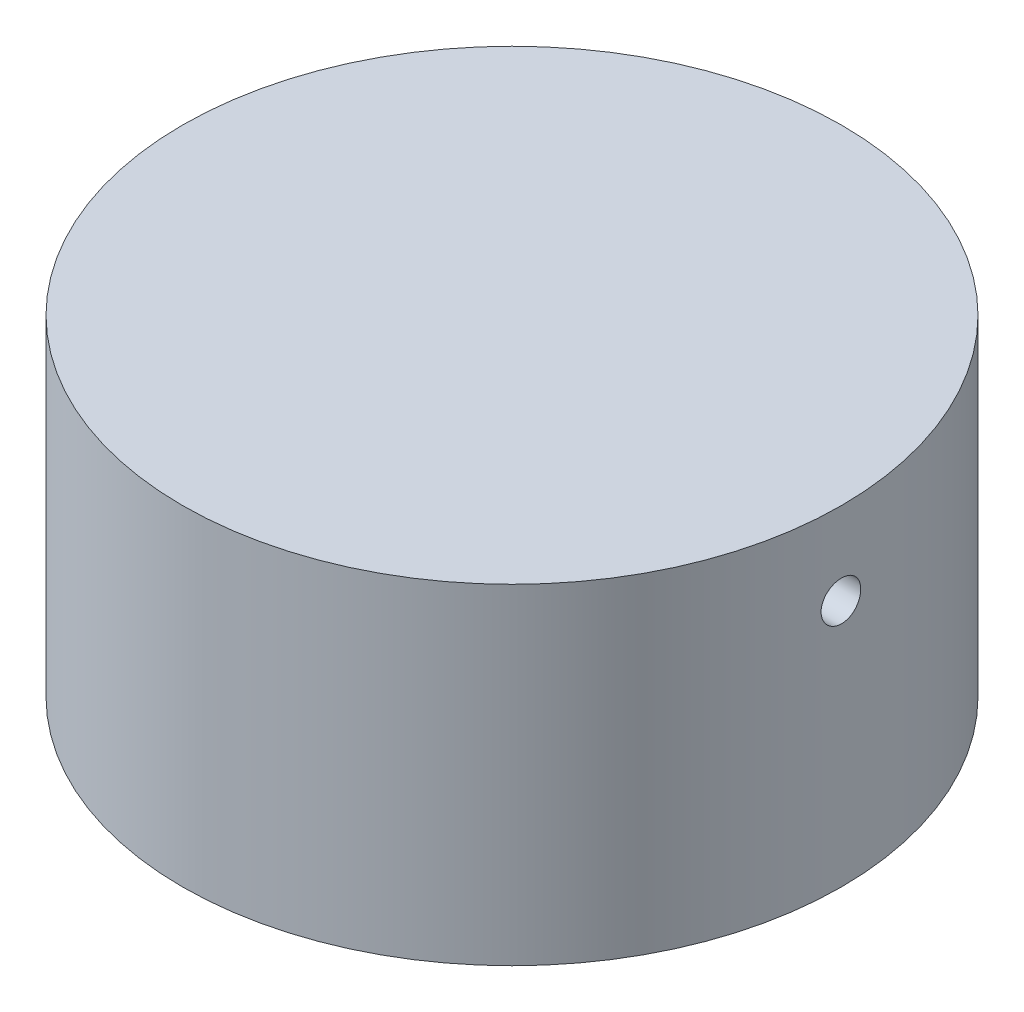
ISO-10303-21;
HEADER;
FILE_DESCRIPTION(('STEP AP214'),'2;1');
FILE_NAME('part.step','',(''),(''),'','','');
FILE_SCHEMA(('AUTOMOTIVE_DESIGN { 1 0 10303 214 1 1 1 1 }'));
ENDSEC;
DATA;
#1=APPLICATION_CONTEXT('core data for automotive mechanical design processes');
#2=APPLICATION_PROTOCOL_DEFINITION('international standard','automotive_design',2000,#1);
#3=PRODUCT_CONTEXT('',#1,'mechanical');
#4=PRODUCT('Part','Part','',(#3));
#5=PRODUCT_RELATED_PRODUCT_CATEGORY('part','',(#4));
#6=PRODUCT_DEFINITION_FORMATION('','',#4);
#7=PRODUCT_DEFINITION_CONTEXT('part definition',#1,'design');
#8=PRODUCT_DEFINITION('design','',#6,#7);
#9=PRODUCT_DEFINITION_SHAPE('','',#8);
#10=(LENGTH_UNIT() NAMED_UNIT(*) SI_UNIT(.MILLI.,.METRE.));
#11=(NAMED_UNIT(*) PLANE_ANGLE_UNIT() SI_UNIT($,.RADIAN.));
#12=(NAMED_UNIT(*) SI_UNIT($,.STERADIAN.) SOLID_ANGLE_UNIT());
#13=UNCERTAINTY_MEASURE_WITH_UNIT(LENGTH_MEASURE(1.E-05),#10,'distance_accuracy_value','');
#14=(GEOMETRIC_REPRESENTATION_CONTEXT(3) GLOBAL_UNCERTAINTY_ASSIGNED_CONTEXT((#13)) GLOBAL_UNIT_ASSIGNED_CONTEXT((#10,
#11,#12)) REPRESENTATION_CONTEXT('',''));
#15=CARTESIAN_POINT('',(0.,0.,0.));
#16=DIRECTION('',(0.,0.,1.));
#17=DIRECTION('',(1.,0.,0.));
#18=AXIS2_PLACEMENT_3D('',#15,#16,#17);
#19=CARTESIAN_POINT('',(0.,20.,0.));
#20=DIRECTION('',(0.,-1.,0.));
#21=DIRECTION('',(0.,0.,-1.));
#22=AXIS2_PLACEMENT_3D('',#19,#20,#21);
#23=CYLINDRICAL_SURFACE('',#22,19.95);
#24=CARTESIAN_POINT('',(0.,20.,0.));
#25=DIRECTION('',(0.,1.,0.));
#26=DIRECTION('',(0.,0.,1.));
#27=AXIS2_PLACEMENT_3D('',#24,#25,#26);
#28=CIRCLE('',#27,19.95);
#29=CARTESIAN_POINT('',(0.,20.,19.95));
#30=VERTEX_POINT('',#29);
#31=EDGE_CURVE('E41',#30,#30,#28,.T.);
#32=ORIENTED_EDGE('',*,*,#31,.F.);
#33=EDGE_LOOP('',(#32));
#34=FACE_BOUND('',#33,.T.);
#35=CARTESIAN_POINT('',(0.,0.,0.));
#36=DIRECTION('',(0.,1.,0.));
#37=DIRECTION('',(0.,0.,1.));
#38=AXIS2_PLACEMENT_3D('',#35,#36,#37);
#39=CIRCLE('',#38,19.95);
#40=CARTESIAN_POINT('',(0.,0.,19.95));
#41=VERTEX_POINT('',#40);
#42=EDGE_CURVE('E45',#41,#41,#39,.T.);
#43=ORIENTED_EDGE('',*,*,#42,.T.);
#44=EDGE_LOOP('',(#43));
#45=FACE_BOUND('',#44,.T.);
#46=CARTESIAN_POINT('',(19.95,16.2,0.));
#47=CARTESIAN_POINT('',(19.9499995195904,16.1999970351863,-0.0673392032796888));
#48=CARTESIAN_POINT('',(19.9496554077135,16.1943127447382,-0.134725680956868));
#49=CARTESIAN_POINT('',(19.9483157594732,16.1717183718967,-0.267638299253196));
#50=CARTESIAN_POINT('',(19.9473194630176,16.1547951907403,-0.333162176005475));
#51=CARTESIAN_POINT('',(19.9447881649979,16.1102105505326,-0.460405083456329));
#52=CARTESIAN_POINT('',(19.943253445673,16.0825547166897,-0.522126087716028));
#53=CARTESIAN_POINT('',(19.9398179626935,16.0172988417651,-0.640033554035088));
#54=CARTESIAN_POINT('',(19.9379172834248,15.9797010924182,-0.696221287490771));
#55=CARTESIAN_POINT('',(19.9339605892219,15.8955709094578,-0.801562049717841));
#56=CARTESIAN_POINT('',(19.9319043859548,15.8490275345117,-0.850706333858018));
#57=CARTESIAN_POINT('',(19.9278700006221,15.7483497355697,-0.940490432843658));
#58=CARTESIAN_POINT('',(19.9258918218043,15.6942149960046,-0.981129893972719));
#59=CARTESIAN_POINT('',(19.9222351322824,15.5798422018062,-1.0527772472416));
#60=CARTESIAN_POINT('',(19.9205568458935,15.519599630955,-1.08377794244232));
#61=CARTESIAN_POINT('',(19.9176916170996,15.3947529235156,-1.13522169841728));
#62=CARTESIAN_POINT('',(19.91650466973,15.3301488310042,-1.15566486586629));
#63=CARTESIAN_POINT('',(19.914757750636,15.1984966195089,-1.18538916906495));
#64=CARTESIAN_POINT('',(19.9141970147641,15.1314515825788,-1.19468390993904));
#65=CARTESIAN_POINT('',(19.9137634633373,14.9967507476594,-1.20188951111929));
#66=CARTESIAN_POINT('',(19.9138906404758,14.9290949561648,-1.19980049233756));
#67=CARTESIAN_POINT('',(19.9148178637493,14.7951857693218,-1.18430917148815));
#68=CARTESIAN_POINT('',(19.9156170345251,14.7289306644413,-1.17092158719099));
#69=CARTESIAN_POINT('',(19.9177968022749,14.5996098153393,-1.13323598396327));
#70=CARTESIAN_POINT('',(19.9191774025227,14.5365440890785,-1.10893790359828));
#71=CARTESIAN_POINT('',(19.9223654479041,14.4153448911841,-1.05010431282407));
#72=CARTESIAN_POINT('',(19.9241731715369,14.3572146714323,-1.01556211912966));
#73=CARTESIAN_POINT('',(19.9280114590695,14.2475721449587,-0.937225675866416));
#74=CARTESIAN_POINT('',(19.9300420252834,14.1960599069753,-0.893431330211505));
#75=CARTESIAN_POINT('',(19.9341010475429,14.1010299504446,-0.797750817738639));
#76=CARTESIAN_POINT('',(19.9361294951175,14.0575250566162,-0.745851912013491));
#77=CARTESIAN_POINT('',(19.9399525798967,13.9798436353991,-0.635480180178088));
#78=CARTESIAN_POINT('',(19.9417472170252,13.9456671110508,-0.57700735192529));
#79=CARTESIAN_POINT('',(19.9449005750174,13.8876136900558,-0.455139882315349));
#80=CARTESIAN_POINT('',(19.9462592756537,13.8637372713172,-0.391745012744579));
#81=CARTESIAN_POINT('',(19.9483873735973,13.826970354815,-0.261836452719707));
#82=CARTESIAN_POINT('',(19.9491567772803,13.8140797381936,-0.195322796016677));
#83=CARTESIAN_POINT('',(19.950018757673,13.79966621713,-0.0611760252065578));
#84=CARTESIAN_POINT('',(19.9501123901849,13.7981255797821,0.00645517708886048));
#85=CARTESIAN_POINT('',(19.9496150841528,13.8064094285311,0.141015069411963));
#86=CARTESIAN_POINT('',(19.9490241489047,13.816233859909,0.207943762820426));
#87=CARTESIAN_POINT('',(19.9472249184295,13.8469542849077,0.33914887631927));
#88=CARTESIAN_POINT('',(19.9460170764425,13.867842150663,0.403427206209046));
#89=CARTESIAN_POINT('',(19.9431199392638,13.9200882625678,0.527565888981595));
#90=CARTESIAN_POINT('',(19.9414306400592,13.9514465959875,0.587426205035611));
#91=CARTESIAN_POINT('',(19.9377578190668,14.0237886896944,0.701110895163078));
#92=CARTESIAN_POINT('',(19.9357739361035,14.0647843022994,0.754927715293815));
#93=CARTESIAN_POINT('',(19.9317364549201,14.1552199742877,0.854921726310395));
#94=CARTESIAN_POINT('',(19.9296828560629,14.2046601108538,0.901098847361945));
#95=CARTESIAN_POINT('',(19.9257343505628,14.3106578676631,0.984562655236377));
#96=CARTESIAN_POINT('',(19.923839651185,14.3672245502967,1.02183784410185));
#97=CARTESIAN_POINT('',(19.9204259016608,14.4858240817493,1.08636104583933));
#98=CARTESIAN_POINT('',(19.9189068493368,14.5478568988777,1.11360911684032));
#99=CARTESIAN_POINT('',(19.9164171909963,14.6755856951122,1.15728467135809));
#100=CARTESIAN_POINT('',(19.9154462172756,14.7412791856964,1.17371941073558));
#101=CARTESIAN_POINT('',(19.9141611909468,14.8744991521949,1.19532548423121));
#102=CARTESIAN_POINT('',(19.9138471323921,14.9420256115113,1.20049692030685));
#103=CARTESIAN_POINT('',(19.9139114967882,15.0768803374791,1.19942861527321));
#104=CARTESIAN_POINT('',(19.9142888226519,15.1442087486174,1.1932069527117));
#105=CARTESIAN_POINT('',(19.915691111094,15.2768631173949,1.1695665200641));
#106=CARTESIAN_POINT('',(19.9167160748594,15.3421890713631,1.15214772945225));
#107=CARTESIAN_POINT('',(19.9192978667085,15.4689870826039,1.10661149791898));
#108=CARTESIAN_POINT('',(19.9208546928107,15.5304591542335,1.07849409685613));
#109=CARTESIAN_POINT('',(19.924324731862,15.6478121967807,1.01236137958934));
#110=CARTESIAN_POINT('',(19.9262379352313,15.7036933179271,0.974346329434146));
#111=CARTESIAN_POINT('',(19.9302086507683,15.8083696715435,0.889430890706554));
#112=CARTESIAN_POINT('',(19.9322663712657,15.8571543497542,0.842517501960036));
#113=CARTESIAN_POINT('',(19.9362925064283,15.946172294726,0.741153238198399));
#114=CARTESIAN_POINT('',(19.9382608990957,15.9864034639958,0.686700519782012));
#115=CARTESIAN_POINT('',(19.9418884756427,16.0571997663253,0.571745286728831));
#116=CARTESIAN_POINT('',(19.9435472920627,16.0877534420354,0.511235711937476));
#117=CARTESIAN_POINT('',(19.9463637675672,16.1382304581597,0.385979810615524));
#118=CARTESIAN_POINT('',(19.9475220143162,16.1581662702803,0.321238555450199));
#119=CARTESIAN_POINT('',(19.9489027390691,16.1816503999745,0.213416622691533));
#120=CARTESIAN_POINT('',(19.9493123874184,16.1885226253078,0.171033198221018));
#121=CARTESIAN_POINT('',(19.9498611707259,16.1976983667314,0.0857729098675622));
#122=CARTESIAN_POINT('',(19.9500003060279,16.2000018886292,0.0428960466119071));
#123=CARTESIAN_POINT('',(19.95,16.2,0.));
#124=B_SPLINE_CURVE_WITH_KNOTS('',3,(#46,#47,#48,#49,#50,#51,#52,#53,#54,#55,#56,#57,#58,#59,
#60,#61,#62,#63,#64,#65,#66,#67,#68,#69,#70,#71,#72,#73,#74,#75,#76,#77,#78,#79,#80,#81,#82,#83,
#84,#85,#86,#87,#88,#89,#90,#91,#92,#93,#94,#95,#96,#97,#98,#99,#100,#101,#102,#103,#104,#105,
#106,#107,#108,#109,#110,#111,#112,#113,#114,#115,#116,#117,#118,#119,#120,#121,#122,#123),
.UNSPECIFIED.,.T.,.F.,(4,2,2,2,2,2,2,2,2,2,2,2,2,2,2,2,2,2,2,2,2,2,2,2,2,2,2,2,2,2,2,2,2,2,2,2,
2,2,4),(0.,0.201861015751006,0.403957711420681,0.605948626715365,0.807893021124415,
1.01008600246821,1.21228739136694,1.4146393966068,1.61698935721326,1.81909212539658,
2.02119274695837,2.22303051322735,2.42486941601134,2.62684028976704,2.82881326114743,
3.03110695375412,3.23340071229165,3.43570385591777,3.6380048107531,3.83998962879593,
4.04197347435382,4.24380913581333,4.44564647959373,4.64773336189573,4.84982209136671,
5.05217044878969,5.25451763314484,5.45672890153618,5.65893833946631,5.86082718983648,
6.0627164102957,6.26460487860676,6.46648792071711,6.66866821120788,6.87089802330792,
7.07336637147005,7.27559637357068,7.40418492415781,7.53277331129416),.UNSPECIFIED.);
#125=CARTESIAN_POINT('',(19.95,16.2,0.));
#126=VERTEX_POINT('',#125);
#127=EDGE_CURVE('E50',#126,#126,#124,.T.);
#128=ORIENTED_EDGE('',*,*,#127,.T.);
#129=EDGE_LOOP('',(#128));
#130=FACE_BOUND('',#129,.T.);
#131=ADVANCED_FACE('F35',(#34,#45,#130),#23,.T.);
#132=CARTESIAN_POINT('',(0.,20.,0.));
#133=DIRECTION('',(0.,1.,0.));
#134=DIRECTION('',(0.,0.,1.));
#135=AXIS2_PLACEMENT_3D('',#132,#133,#134);
#136=PLANE('',#135);
#137=ORIENTED_EDGE('',*,*,#31,.T.);
#138=EDGE_LOOP('',(#137));
#139=FACE_BOUND('',#138,.T.);
#140=ADVANCED_FACE('F67',(#139),#136,.T.);
#141=CARTESIAN_POINT('',(0.,0.,0.));
#142=DIRECTION('',(0.,1.,0.));
#143=DIRECTION('',(0.,0.,1.));
#144=AXIS2_PLACEMENT_3D('',#141,#142,#143);
#145=PLANE('',#144);
#146=CARTESIAN_POINT('',(15.,0.,0.));
#147=DIRECTION('',(0.,-1.,0.));
#148=DIRECTION('',(0.,0.,-1.));
#149=AXIS2_PLACEMENT_3D('',#146,#147,#148);
#150=CIRCLE('',#149,1.65);
#151=CARTESIAN_POINT('',(15.,0.,-1.65));
#152=VERTEX_POINT('',#151);
#153=EDGE_CURVE('E128',#152,#152,#150,.T.);
#154=ORIENTED_EDGE('',*,*,#153,.F.);
#155=EDGE_LOOP('',(#154));
#156=FACE_BOUND('',#155,.T.);
#157=CARTESIAN_POINT('',(0.,0.,-15.));
#158=DIRECTION('',(0.,-1.,0.));
#159=DIRECTION('',(0.,0.,-1.));
#160=AXIS2_PLACEMENT_3D('',#157,#158,#159);
#161=CIRCLE('',#160,1.65);
#162=CARTESIAN_POINT('',(0.,0.,-16.65));
#163=VERTEX_POINT('',#162);
#164=EDGE_CURVE('E125',#163,#163,#161,.T.);
#165=ORIENTED_EDGE('',*,*,#164,.F.);
#166=EDGE_LOOP('',(#165));
#167=FACE_BOUND('',#166,.T.);
#168=CARTESIAN_POINT('',(0.,0.,15.));
#169=DIRECTION('',(0.,-1.,0.));
#170=DIRECTION('',(0.,0.,-1.));
#171=AXIS2_PLACEMENT_3D('',#168,#169,#170);
#172=CIRCLE('',#171,1.65);
#173=CARTESIAN_POINT('',(0.,0.,13.35));
#174=VERTEX_POINT('',#173);
#175=EDGE_CURVE('E119',#174,#174,#172,.T.);
#176=ORIENTED_EDGE('',*,*,#175,.F.);
#177=EDGE_LOOP('',(#176));
#178=FACE_BOUND('',#177,.T.);
#179=CARTESIAN_POINT('',(-15.,0.,0.));
#180=DIRECTION('',(0.,-1.,0.));
#181=DIRECTION('',(0.,0.,-1.));
#182=AXIS2_PLACEMENT_3D('',#179,#180,#181);
#183=CIRCLE('',#182,1.65);
#184=CARTESIAN_POINT('',(-15.,0.,-1.65));
#185=VERTEX_POINT('',#184);
#186=EDGE_CURVE('E113',#185,#185,#183,.T.);
#187=ORIENTED_EDGE('',*,*,#186,.F.);
#188=EDGE_LOOP('',(#187));
#189=FACE_BOUND('',#188,.T.);
#190=CARTESIAN_POINT('',(0.,0.,0.));
#191=DIRECTION('',(0.,1.,0.));
#192=DIRECTION('',(0.,0.,1.));
#193=AXIS2_PLACEMENT_3D('',#190,#191,#192);
#194=CIRCLE('',#193,1.9);
#195=CARTESIAN_POINT('',(0.,0.,1.9));
#196=VERTEX_POINT('',#195);
#197=EDGE_CURVE('E10',#196,#196,#194,.F.);
#198=ORIENTED_EDGE('',*,*,#197,.F.);
#199=EDGE_LOOP('',(#198));
#200=FACE_BOUND('',#199,.T.);
#201=ORIENTED_EDGE('',*,*,#42,.F.);
#202=EDGE_LOOP('',(#201));
#203=FACE_BOUND('',#202,.T.);
#204=ADVANCED_FACE('F69',(#156,#167,#178,#189,#200,#203),#145,.F.);
#205=CARTESIAN_POINT('',(0.,-4.,0.));
#206=DIRECTION('',(0.,1.,0.));
#207=DIRECTION('',(0.,0.,1.));
#208=AXIS2_PLACEMENT_3D('',#205,#206,#207);
#209=CYLINDRICAL_SURFACE('',#208,1.2);
#210=CARTESIAN_POINT('',(0.,0.,0.));
#211=DIRECTION('',(0.,1.,0.));
#212=DIRECTION('',(0.,0.,1.));
#213=AXIS2_PLACEMENT_3D('',#210,#211,#212);
#214=CIRCLE('',#213,1.2);
#215=CARTESIAN_POINT('',(0.,0.,1.2));
#216=VERTEX_POINT('',#215);
#217=EDGE_CURVE('E96',#216,#216,#214,.T.);
#218=ORIENTED_EDGE('',*,*,#217,.F.);
#219=EDGE_LOOP('',(#218));
#220=FACE_BOUND('',#219,.T.);
#221=CARTESIAN_POINT('',(0.,10.,0.));
#222=DIRECTION('',(0.,-1.,0.));
#223=DIRECTION('',(0.,0.,-1.));
#224=AXIS2_PLACEMENT_3D('',#221,#222,#223);
#225=CIRCLE('',#224,1.2);
#226=CARTESIAN_POINT('',(-1.2,10.,0.));
#227=VERTEX_POINT('',#226);
#228=EDGE_CURVE('E60',#227,#227,#225,.T.);
#229=ORIENTED_EDGE('',*,*,#228,.F.);
#230=EDGE_LOOP('',(#229));
#231=FACE_BOUND('',#230,.T.);
#232=ADVANCED_FACE('F71',(#220,#231),#209,.F.);
#233=CARTESIAN_POINT('',(5.,10.,0.));
#234=DIRECTION('',(0.,0.,-1.));
#235=DIRECTION('',(-1.,0.,0.));
#236=AXIS2_PLACEMENT_3D('',#233,#234,#235);
#237=TOROIDAL_SURFACE('',#236,5.,1.2);
#238=CARTESIAN_POINT('',(5.,15.,0.));
#239=DIRECTION('',(-1.,0.,0.));
#240=DIRECTION('',(0.,0.,-1.));
#241=AXIS2_PLACEMENT_3D('',#238,#239,#240);
#242=CIRCLE('',#241,1.2);
#243=CARTESIAN_POINT('',(5.,16.2,0.));
#244=VERTEX_POINT('',#243);
#245=EDGE_CURVE('E59',#244,#244,#242,.T.);
#246=CARTESIAN_POINT('',(5.,10.,0.));
#247=DIRECTION('',(0.,0.,-1.));
#248=DIRECTION('',(-1.,0.,0.));
#249=AXIS2_PLACEMENT_3D('',#246,#247,#248);
#250=CIRCLE('',#249,6.2);
#251=EDGE_CURVE('',#227,#244,#250,.T.);
#252=ORIENTED_EDGE('',*,*,#228,.T.);
#253=ORIENTED_EDGE('',*,*,#245,.F.);
#254=ORIENTED_EDGE('',*,*,#251,.T.);
#255=ORIENTED_EDGE('',*,*,#251,.F.);
#256=EDGE_LOOP('',(#252,#254,#253,#255));
#257=FACE_BOUND('',#256,.T.);
#258=ADVANCED_FACE('F76',(#257),#237,.F.);
#259=CARTESIAN_POINT('',(5.,15.,0.));
#260=DIRECTION('',(1.,0.,0.));
#261=DIRECTION('',(0.,1.,0.));
#262=AXIS2_PLACEMENT_3D('',#259,#260,#261);
#263=CYLINDRICAL_SURFACE('',#262,1.2);
#264=ORIENTED_EDGE('',*,*,#127,.F.);
#265=EDGE_LOOP('',(#264));
#266=FACE_BOUND('',#265,.T.);
#267=ORIENTED_EDGE('',*,*,#245,.T.);
#268=EDGE_LOOP('',(#267));
#269=FACE_BOUND('',#268,.T.);
#270=ADVANCED_FACE('F62',(#266,#269),#263,.F.);
#271=CARTESIAN_POINT('',(0.,0.,0.));
#272=DIRECTION('',(0.,-1.,0.));
#273=DIRECTION('',(0.,0.,-1.));
#274=AXIS2_PLACEMENT_3D('',#271,#272,#273);
#275=PLANE('',#274);
#276=CARTESIAN_POINT('',(0.,0.,0.));
#277=DIRECTION('',(0.,-1.,0.));
#278=DIRECTION('',(0.,0.,-1.));
#279=AXIS2_PLACEMENT_3D('',#276,#277,#278);
#280=CIRCLE('',#279,0.9);
#281=CARTESIAN_POINT('',(0.,0.,-0.9));
#282=VERTEX_POINT('',#281);
#283=EDGE_CURVE('E103',#282,#282,#280,.T.);
#284=ORIENTED_EDGE('',*,*,#283,.T.);
#285=EDGE_LOOP('',(#284));
#286=FACE_BOUND('',#285,.T.);
#287=ORIENTED_EDGE('',*,*,#217,.T.);
#288=EDGE_LOOP('',(#287));
#289=FACE_BOUND('',#288,.T.);
#290=ADVANCED_FACE('F78',(#286,#289),#275,.F.);
#291=CARTESIAN_POINT('',(0.,-10.,0.));
#292=DIRECTION('',(0.,1.,0.));
#293=DIRECTION('',(0.,0.,1.));
#294=AXIS2_PLACEMENT_3D('',#291,#292,#293);
#295=CYLINDRICAL_SURFACE('',#294,1.9);
#296=CARTESIAN_POINT('',(0.,-10.,0.));
#297=DIRECTION('',(0.,-1.,0.));
#298=DIRECTION('',(0.,0.,-1.));
#299=AXIS2_PLACEMENT_3D('',#296,#297,#298);
#300=CIRCLE('',#299,1.9);
#301=CARTESIAN_POINT('',(0.,-10.,-1.9));
#302=VERTEX_POINT('',#301);
#303=EDGE_CURVE('E100',#302,#302,#300,.T.);
#304=ORIENTED_EDGE('',*,*,#303,.F.);
#305=EDGE_LOOP('',(#304));
#306=FACE_BOUND('',#305,.T.);
#307=ORIENTED_EDGE('',*,*,#197,.T.);
#308=EDGE_LOOP('',(#307));
#309=FACE_BOUND('',#308,.T.);
#310=ADVANCED_FACE('F176',(#306,#309),#295,.T.);
#311=CARTESIAN_POINT('',(0.,-10.,0.));
#312=DIRECTION('',(0.,-1.,0.));
#313=DIRECTION('',(0.,0.,-1.));
#314=AXIS2_PLACEMENT_3D('',#311,#312,#313);
#315=PLANE('',#314);
#316=CARTESIAN_POINT('',(0.,-10.,0.));
#317=DIRECTION('',(0.,-1.,0.));
#318=DIRECTION('',(0.,0.,-1.));
#319=AXIS2_PLACEMENT_3D('',#316,#317,#318);
#320=CIRCLE('',#319,0.9);
#321=CARTESIAN_POINT('',(0.,-10.,-0.9));
#322=VERTEX_POINT('',#321);
#323=EDGE_CURVE('E104',#322,#322,#320,.T.);
#324=ORIENTED_EDGE('',*,*,#323,.F.);
#325=EDGE_LOOP('',(#324));
#326=FACE_BOUND('',#325,.T.);
#327=ORIENTED_EDGE('',*,*,#303,.T.);
#328=EDGE_LOOP('',(#327));
#329=FACE_BOUND('',#328,.T.);
#330=ADVANCED_FACE('F172',(#326,#329),#315,.T.);
#331=CARTESIAN_POINT('',(0.,0.,0.));
#332=DIRECTION('',(0.,-1.,0.));
#333=DIRECTION('',(0.,0.,-1.));
#334=AXIS2_PLACEMENT_3D('',#331,#332,#333);
#335=CYLINDRICAL_SURFACE('',#334,0.9);
#336=ORIENTED_EDGE('',*,*,#283,.F.);
#337=EDGE_LOOP('',(#336));
#338=FACE_BOUND('',#337,.T.);
#339=ORIENTED_EDGE('',*,*,#323,.T.);
#340=EDGE_LOOP('',(#339));
#341=FACE_BOUND('',#340,.T.);
#342=ADVANCED_FACE('F165',(#338,#341),#335,.F.);
#343=CARTESIAN_POINT('',(-15.,5.5,0.));
#344=DIRECTION('',(0.,-1.,0.));
#345=DIRECTION('',(0.,0.,-1.));
#346=AXIS2_PLACEMENT_3D('',#343,#344,#345);
#347=CYLINDRICAL_SURFACE('',#346,1.65);
#348=CARTESIAN_POINT('',(-15.,5.5,0.));
#349=DIRECTION('',(0.,-1.,0.));
#350=DIRECTION('',(0.,0.,-1.));
#351=AXIS2_PLACEMENT_3D('',#348,#349,#350);
#352=CIRCLE('',#351,1.65);
#353=CARTESIAN_POINT('',(-15.,5.5,-1.65));
#354=VERTEX_POINT('',#353);
#355=EDGE_CURVE('E110',#354,#354,#352,.T.);
#356=ORIENTED_EDGE('',*,*,#355,.F.);
#357=EDGE_LOOP('',(#356));
#358=FACE_BOUND('',#357,.T.);
#359=ORIENTED_EDGE('',*,*,#186,.T.);
#360=EDGE_LOOP('',(#359));
#361=FACE_BOUND('',#360,.T.);
#362=ADVANCED_FACE('F162',(#358,#361),#347,.F.);
#363=CARTESIAN_POINT('',(-15.,5.5,0.));
#364=DIRECTION('',(0.,-1.,0.));
#365=DIRECTION('',(0.,0.,-1.));
#366=AXIS2_PLACEMENT_3D('',#363,#364,#365);
#367=PLANE('',#366);
#368=ORIENTED_EDGE('',*,*,#355,.T.);
#369=EDGE_LOOP('',(#368));
#370=FACE_BOUND('',#369,.T.);
#371=ADVANCED_FACE('F157',(#370),#367,.T.);
#372=CARTESIAN_POINT('',(0.,5.5,15.));
#373=DIRECTION('',(0.,-1.,0.));
#374=DIRECTION('',(0.,0.,-1.));
#375=AXIS2_PLACEMENT_3D('',#372,#373,#374);
#376=CYLINDRICAL_SURFACE('',#375,1.65);
#377=CARTESIAN_POINT('',(0.,5.5,15.));
#378=DIRECTION('',(0.,-1.,0.));
#379=DIRECTION('',(0.,0.,-1.));
#380=AXIS2_PLACEMENT_3D('',#377,#378,#379);
#381=CIRCLE('',#380,1.65);
#382=CARTESIAN_POINT('',(0.,5.5,13.35));
#383=VERTEX_POINT('',#382);
#384=EDGE_CURVE('E116',#383,#383,#381,.T.);
#385=ORIENTED_EDGE('',*,*,#384,.F.);
#386=EDGE_LOOP('',(#385));
#387=FACE_BOUND('',#386,.T.);
#388=ORIENTED_EDGE('',*,*,#175,.T.);
#389=EDGE_LOOP('',(#388));
#390=FACE_BOUND('',#389,.T.);
#391=ADVANCED_FACE('F154',(#387,#390),#376,.F.);
#392=CARTESIAN_POINT('',(0.,5.5,15.));
#393=DIRECTION('',(0.,-1.,0.));
#394=DIRECTION('',(0.,0.,-1.));
#395=AXIS2_PLACEMENT_3D('',#392,#393,#394);
#396=PLANE('',#395);
#397=ORIENTED_EDGE('',*,*,#384,.T.);
#398=EDGE_LOOP('',(#397));
#399=FACE_BOUND('',#398,.T.);
#400=ADVANCED_FACE('F151',(#399),#396,.T.);
#401=CARTESIAN_POINT('',(0.,5.5,-15.));
#402=DIRECTION('',(0.,-1.,0.));
#403=DIRECTION('',(0.,0.,-1.));
#404=AXIS2_PLACEMENT_3D('',#401,#402,#403);
#405=CYLINDRICAL_SURFACE('',#404,1.65);
#406=CARTESIAN_POINT('',(0.,5.5,-15.));
#407=DIRECTION('',(0.,-1.,0.));
#408=DIRECTION('',(0.,0.,-1.));
#409=AXIS2_PLACEMENT_3D('',#406,#407,#408);
#410=CIRCLE('',#409,1.65);
#411=CARTESIAN_POINT('',(0.,5.5,-16.65));
#412=VERTEX_POINT('',#411);
#413=EDGE_CURVE('E122',#412,#412,#410,.T.);
#414=ORIENTED_EDGE('',*,*,#413,.F.);
#415=EDGE_LOOP('',(#414));
#416=FACE_BOUND('',#415,.T.);
#417=ORIENTED_EDGE('',*,*,#164,.T.);
#418=EDGE_LOOP('',(#417));
#419=FACE_BOUND('',#418,.T.);
#420=ADVANCED_FACE('F146',(#416,#419),#405,.F.);
#421=CARTESIAN_POINT('',(0.,5.5,-15.));
#422=DIRECTION('',(0.,-1.,0.));
#423=DIRECTION('',(0.,0.,-1.));
#424=AXIS2_PLACEMENT_3D('',#421,#422,#423);
#425=PLANE('',#424);
#426=ORIENTED_EDGE('',*,*,#413,.T.);
#427=EDGE_LOOP('',(#426));
#428=FACE_BOUND('',#427,.T.);
#429=ADVANCED_FACE('F139',(#428),#425,.T.);
#430=CARTESIAN_POINT('',(15.,5.5,0.));
#431=DIRECTION('',(0.,-1.,0.));
#432=DIRECTION('',(0.,0.,-1.));
#433=AXIS2_PLACEMENT_3D('',#430,#431,#432);
#434=CYLINDRICAL_SURFACE('',#433,1.65);
#435=CARTESIAN_POINT('',(15.,5.5,0.));
#436=DIRECTION('',(0.,-1.,0.));
#437=DIRECTION('',(0.,0.,-1.));
#438=AXIS2_PLACEMENT_3D('',#435,#436,#437);
#439=CIRCLE('',#438,1.65);
#440=CARTESIAN_POINT('',(15.,5.5,-1.65));
#441=VERTEX_POINT('',#440);
#442=EDGE_CURVE('E107',#441,#441,#439,.T.);
#443=ORIENTED_EDGE('',*,*,#442,.F.);
#444=EDGE_LOOP('',(#443));
#445=FACE_BOUND('',#444,.T.);
#446=ORIENTED_EDGE('',*,*,#153,.T.);
#447=EDGE_LOOP('',(#446));
#448=FACE_BOUND('',#447,.T.);
#449=ADVANCED_FACE('F136',(#445,#448),#434,.F.);
#450=CARTESIAN_POINT('',(15.,5.5,0.));
#451=DIRECTION('',(0.,-1.,0.));
#452=DIRECTION('',(0.,0.,-1.));
#453=AXIS2_PLACEMENT_3D('',#450,#451,#452);
#454=PLANE('',#453);
#455=ORIENTED_EDGE('',*,*,#442,.T.);
#456=EDGE_LOOP('',(#455));
#457=FACE_BOUND('',#456,.T.);
#458=ADVANCED_FACE('F134',(#457),#454,.T.);
#459=CLOSED_SHELL('',(#131,#140,#204,#232,#258,#270,#290,#310,#330,#342,#362,#371,#391,#400,
#420,#429,#449,#458));
#460=MANIFOLD_SOLID_BREP('B2',#459);
#461=ADVANCED_BREP_SHAPE_REPRESENTATION('',(#18,#460),#14);
#462=SHAPE_DEFINITION_REPRESENTATION(#9,#461);
ENDSEC;
END-ISO-10303-21;
